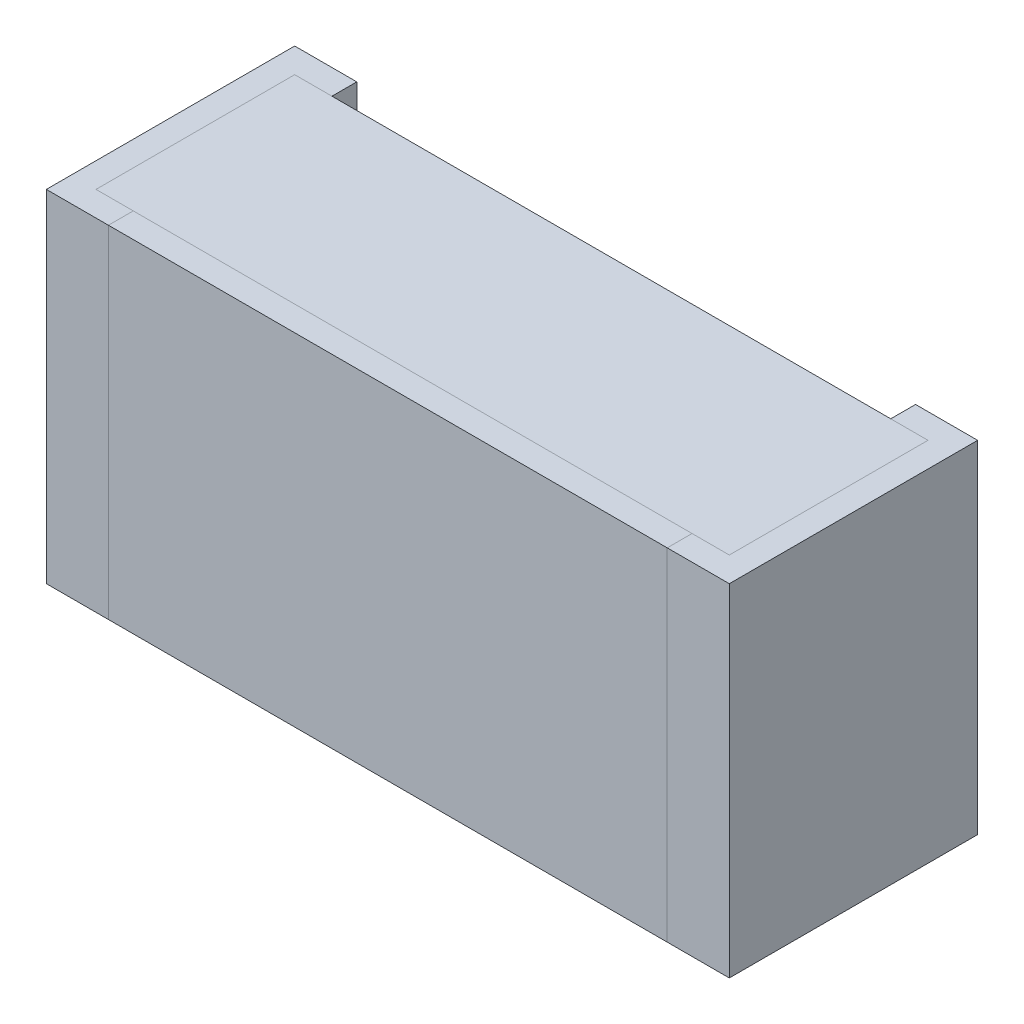
ISO-10303-21;
HEADER;
FILE_DESCRIPTION(('STEP AP214'),'2;1');
FILE_NAME('part.step','',(''),(''),'','','');
FILE_SCHEMA(('AUTOMOTIVE_DESIGN { 1 0 10303 214 1 1 1 1 }'));
ENDSEC;
DATA;
#1=APPLICATION_CONTEXT('core data for automotive mechanical design processes');
#2=APPLICATION_PROTOCOL_DEFINITION('international standard','automotive_design',2000,#1);
#3=PRODUCT_CONTEXT('',#1,'mechanical');
#4=PRODUCT('Part','Part','',(#3));
#5=PRODUCT_RELATED_PRODUCT_CATEGORY('part','',(#4));
#6=PRODUCT_DEFINITION_FORMATION('','',#4);
#7=PRODUCT_DEFINITION_CONTEXT('part definition',#1,'design');
#8=PRODUCT_DEFINITION('design','',#6,#7);
#9=PRODUCT_DEFINITION_SHAPE('','',#8);
#10=(LENGTH_UNIT() NAMED_UNIT(*) SI_UNIT(.MILLI.,.METRE.));
#11=(NAMED_UNIT(*) PLANE_ANGLE_UNIT() SI_UNIT($,.RADIAN.));
#12=(NAMED_UNIT(*) SI_UNIT($,.STERADIAN.) SOLID_ANGLE_UNIT());
#13=UNCERTAINTY_MEASURE_WITH_UNIT(LENGTH_MEASURE(1.E-05),#10,'distance_accuracy_value','');
#14=(GEOMETRIC_REPRESENTATION_CONTEXT(3) GLOBAL_UNCERTAINTY_ASSIGNED_CONTEXT((#13)) GLOBAL_UNIT_ASSIGNED_CONTEXT((#10,
#11,#12)) REPRESENTATION_CONTEXT('',''));
#15=CARTESIAN_POINT('',(0.,0.,0.));
#16=DIRECTION('',(0.,0.,1.));
#17=DIRECTION('',(1.,0.,0.));
#18=AXIS2_PLACEMENT_3D('',#15,#16,#17);
#19=CARTESIAN_POINT('',(-0.51,-0.275,0.04));
#20=DIRECTION('',(1.,0.,0.));
#21=DIRECTION('',(0.,0.,1.));
#22=AXIS2_PLACEMENT_3D('',#19,#20,#21);
#23=PLANE('',#22);
#24=DIRECTION('',(0.,1.,0.));
#25=VECTOR('',#24,1.);
#26=CARTESIAN_POINT('',(-0.51,-0.275,0.36));
#27=LINE('',#26,#25);
#28=CARTESIAN_POINT('',(-0.51,-0.275,0.36));
#29=VERTEX_POINT('',#28);
#30=CARTESIAN_POINT('',(-0.51,0.275,0.36));
#31=VERTEX_POINT('',#30);
#32=EDGE_CURVE('P0_E11',#29,#31,#27,.T.);
#33=ORIENTED_EDGE('',*,*,#32,.T.);
#34=DIRECTION('',(0.,0.,1.));
#35=VECTOR('',#34,1.);
#36=CARTESIAN_POINT('',(-0.51,0.275,0.04));
#37=LINE('',#36,#35);
#38=CARTESIAN_POINT('',(-0.51,0.275,0.04));
#39=VERTEX_POINT('',#38);
#40=EDGE_CURVE('P0_E23',#39,#31,#37,.T.);
#41=ORIENTED_EDGE('',*,*,#40,.F.);
#42=DIRECTION('',(0.,1.,0.));
#43=VECTOR('',#42,1.);
#44=CARTESIAN_POINT('',(-0.51,-0.275,0.04));
#45=LINE('',#44,#43);
#46=CARTESIAN_POINT('',(-0.51,-0.275,0.04));
#47=VERTEX_POINT('',#46);
#48=EDGE_CURVE('P0_E85',#47,#39,#45,.T.);
#49=ORIENTED_EDGE('',*,*,#48,.F.);
#50=DIRECTION('',(0.,0.,1.));
#51=VECTOR('',#50,1.);
#52=CARTESIAN_POINT('',(-0.51,-0.275,0.04));
#53=LINE('',#52,#51);
#54=EDGE_CURVE('P0_E35',#47,#29,#53,.T.);
#55=ORIENTED_EDGE('',*,*,#54,.T.);
#56=EDGE_LOOP('',(#33,#41,#49,#55));
#57=FACE_BOUND('',#56,.T.);
#58=ADVANCED_FACE('P0_F16',(#57),#23,.F.);
#59=CARTESIAN_POINT('',(0.51,-0.275,0.04));
#60=DIRECTION('',(1.,0.,0.));
#61=DIRECTION('',(0.,0.,1.));
#62=AXIS2_PLACEMENT_3D('',#59,#60,#61);
#63=PLANE('',#62);
#64=DIRECTION('',(0.,0.,1.));
#65=VECTOR('',#64,1.);
#66=CARTESIAN_POINT('',(0.51,-0.275,0.04));
#67=LINE('',#66,#65);
#68=CARTESIAN_POINT('',(0.51,-0.275,0.04));
#69=VERTEX_POINT('',#68);
#70=CARTESIAN_POINT('',(0.51,-0.275,0.36));
#71=VERTEX_POINT('',#70);
#72=EDGE_CURVE('P0_E82',#69,#71,#67,.T.);
#73=ORIENTED_EDGE('',*,*,#72,.F.);
#74=DIRECTION('',(0.,1.,0.));
#75=VECTOR('',#74,1.);
#76=CARTESIAN_POINT('',(0.51,-0.275,0.04));
#77=LINE('',#76,#75);
#78=CARTESIAN_POINT('',(0.51,0.275,0.04));
#79=VERTEX_POINT('',#78);
#80=EDGE_CURVE('P0_E62',#69,#79,#77,.T.);
#81=ORIENTED_EDGE('',*,*,#80,.T.);
#82=DIRECTION('',(0.,0.,1.));
#83=VECTOR('',#82,1.);
#84=CARTESIAN_POINT('',(0.51,0.275,0.04));
#85=LINE('',#84,#83);
#86=CARTESIAN_POINT('',(0.51,0.275,0.36));
#87=VERTEX_POINT('',#86);
#88=EDGE_CURVE('P0_E56',#79,#87,#85,.T.);
#89=ORIENTED_EDGE('',*,*,#88,.T.);
#90=DIRECTION('',(0.,1.,0.));
#91=VECTOR('',#90,1.);
#92=CARTESIAN_POINT('',(0.51,-0.275,0.36));
#93=LINE('',#92,#91);
#94=EDGE_CURVE('P0_E59',#71,#87,#93,.T.);
#95=ORIENTED_EDGE('',*,*,#94,.F.);
#96=EDGE_LOOP('',(#73,#81,#89,#95));
#97=FACE_BOUND('',#96,.T.);
#98=ADVANCED_FACE('P0_F58',(#97),#63,.T.);
#99=CARTESIAN_POINT('',(-0.51,-0.275,0.04));
#100=DIRECTION('',(0.,1.,0.));
#101=DIRECTION('',(0.,0.,1.));
#102=AXIS2_PLACEMENT_3D('',#99,#100,#101);
#103=PLANE('',#102);
#104=ORIENTED_EDGE('',*,*,#72,.T.);
#105=DIRECTION('',(1.,0.,0.));
#106=VECTOR('',#105,1.);
#107=CARTESIAN_POINT('',(-0.51,-0.275,0.36));
#108=LINE('',#107,#106);
#109=EDGE_CURVE('P0_E70',#29,#71,#108,.T.);
#110=ORIENTED_EDGE('',*,*,#109,.F.);
#111=ORIENTED_EDGE('',*,*,#54,.F.);
#112=DIRECTION('',(1.,0.,0.));
#113=VECTOR('',#112,1.);
#114=CARTESIAN_POINT('',(-0.51,-0.275,0.04));
#115=LINE('',#114,#113);
#116=EDGE_CURVE('P0_E75',#47,#69,#115,.T.);
#117=ORIENTED_EDGE('',*,*,#116,.T.);
#118=EDGE_LOOP('',(#104,#110,#111,#117));
#119=FACE_BOUND('',#118,.T.);
#120=ADVANCED_FACE('P0_F90',(#119),#103,.F.);
#121=CARTESIAN_POINT('',(-0.51,0.275,0.04));
#122=DIRECTION('',(0.,1.,0.));
#123=DIRECTION('',(0.,0.,1.));
#124=AXIS2_PLACEMENT_3D('',#121,#122,#123);
#125=PLANE('',#124);
#126=DIRECTION('',(1.,0.,0.));
#127=VECTOR('',#126,1.);
#128=CARTESIAN_POINT('',(-0.51,0.275,0.04));
#129=LINE('',#128,#127);
#130=EDGE_CURVE('P0_E73',#39,#79,#129,.T.);
#131=ORIENTED_EDGE('',*,*,#130,.F.);
#132=ORIENTED_EDGE('',*,*,#40,.T.);
#133=DIRECTION('',(1.,0.,0.));
#134=VECTOR('',#133,1.);
#135=CARTESIAN_POINT('',(-0.51,0.275,0.36));
#136=LINE('',#135,#134);
#137=EDGE_CURVE('P0_E68',#31,#87,#136,.T.);
#138=ORIENTED_EDGE('',*,*,#137,.T.);
#139=ORIENTED_EDGE('',*,*,#88,.F.);
#140=EDGE_LOOP('',(#131,#132,#138,#139));
#141=FACE_BOUND('',#140,.T.);
#142=ADVANCED_FACE('P0_F72',(#141),#125,.T.);
#143=CARTESIAN_POINT('',(-0.51,-0.275,0.04));
#144=DIRECTION('',(0.,0.,1.));
#145=DIRECTION('',(1.,0.,0.));
#146=AXIS2_PLACEMENT_3D('',#143,#144,#145);
#147=PLANE('',#146);
#148=ORIENTED_EDGE('',*,*,#130,.T.);
#149=ORIENTED_EDGE('',*,*,#80,.F.);
#150=ORIENTED_EDGE('',*,*,#116,.F.);
#151=ORIENTED_EDGE('',*,*,#48,.T.);
#152=EDGE_LOOP('',(#148,#149,#150,#151));
#153=FACE_BOUND('',#152,.T.);
#154=ADVANCED_FACE('P0_F88',(#153),#147,.F.);
#155=CARTESIAN_POINT('',(-0.51,-0.275,0.36));
#156=DIRECTION('',(0.,0.,1.));
#157=DIRECTION('',(1.,0.,0.));
#158=AXIS2_PLACEMENT_3D('',#155,#156,#157);
#159=PLANE('',#158);
#160=ORIENTED_EDGE('',*,*,#32,.F.);
#161=ORIENTED_EDGE('',*,*,#109,.T.);
#162=ORIENTED_EDGE('',*,*,#94,.T.);
#163=ORIENTED_EDGE('',*,*,#137,.F.);
#164=EDGE_LOOP('',(#160,#161,#162,#163));
#165=FACE_BOUND('',#164,.T.);
#166=ADVANCED_FACE('P0_F67',(#165),#159,.T.);
#167=CLOSED_SHELL('',(#58,#98,#120,#142,#154,#166));
#168=MANIFOLD_SOLID_BREP('P0_B1',#167);
#169=CARTESIAN_POINT('',(-0.55,-0.275,0.));
#170=DIRECTION('',(1.,0.,0.));
#171=DIRECTION('',(0.,0.,1.));
#172=AXIS2_PLACEMENT_3D('',#169,#170,#171);
#173=PLANE('',#172);
#174=DIRECTION('',(0.,1.,0.));
#175=VECTOR('',#174,1.);
#176=CARTESIAN_POINT('',(-0.55,-0.275,0.4));
#177=LINE('',#176,#175);
#178=CARTESIAN_POINT('',(-0.55,-0.275,0.4));
#179=VERTEX_POINT('',#178);
#180=CARTESIAN_POINT('',(-0.55,0.275,0.4));
#181=VERTEX_POINT('',#180);
#182=EDGE_CURVE('P1_E11',#179,#181,#177,.T.);
#183=ORIENTED_EDGE('',*,*,#182,.T.);
#184=DIRECTION('',(0.,0.,1.));
#185=VECTOR('',#184,1.);
#186=CARTESIAN_POINT('',(-0.55,0.275,0.));
#187=LINE('',#186,#185);
#188=CARTESIAN_POINT('',(-0.55,0.275,0.));
#189=VERTEX_POINT('',#188);
#190=EDGE_CURVE('P1_E23',#189,#181,#187,.T.);
#191=ORIENTED_EDGE('',*,*,#190,.F.);
#192=DIRECTION('',(0.,1.,0.));
#193=VECTOR('',#192,1.);
#194=CARTESIAN_POINT('',(-0.55,-0.275,0.));
#195=LINE('',#194,#193);
#196=CARTESIAN_POINT('',(-0.55,-0.275,0.));
#197=VERTEX_POINT('',#196);
#198=EDGE_CURVE('P1_E143',#197,#189,#195,.T.);
#199=ORIENTED_EDGE('',*,*,#198,.F.);
#200=DIRECTION('',(0.,0.,1.));
#201=VECTOR('',#200,1.);
#202=CARTESIAN_POINT('',(-0.55,-0.275,0.));
#203=LINE('',#202,#201);
#204=EDGE_CURVE('P1_E35',#197,#179,#203,.T.);
#205=ORIENTED_EDGE('',*,*,#204,.T.);
#206=EDGE_LOOP('',(#183,#191,#199,#205));
#207=FACE_BOUND('',#206,.T.);
#208=ADVANCED_FACE('P1_F16',(#207),#173,.F.);
#209=CARTESIAN_POINT('',(-0.55,-0.275,0.));
#210=DIRECTION('',(0.,1.,0.));
#211=DIRECTION('',(0.,0.,1.));
#212=AXIS2_PLACEMENT_3D('',#209,#210,#211);
#213=PLANE('',#212);
#214=DIRECTION('',(1.,0.,0.));
#215=VECTOR('',#214,1.);
#216=CARTESIAN_POINT('',(-0.51,-0.275,0.04));
#217=LINE('',#216,#215);
#218=CARTESIAN_POINT('',(-0.51,-0.275,0.04));
#219=VERTEX_POINT('',#218);
#220=CARTESIAN_POINT('',(-0.45,-0.275,0.04));
#221=VERTEX_POINT('',#220);
#222=EDGE_CURVE('P1_E140',#219,#221,#217,.T.);
#223=ORIENTED_EDGE('',*,*,#222,.F.);
#224=DIRECTION('',(0.,0.,1.));
#225=VECTOR('',#224,1.);
#226=CARTESIAN_POINT('',(-0.51,-0.275,0.04));
#227=LINE('',#226,#225);
#228=CARTESIAN_POINT('',(-0.51,-0.275,0.36));
#229=VERTEX_POINT('',#228);
#230=EDGE_CURVE('P1_E102',#219,#229,#227,.T.);
#231=ORIENTED_EDGE('',*,*,#230,.T.);
#232=DIRECTION('',(1.,0.,0.));
#233=VECTOR('',#232,1.);
#234=CARTESIAN_POINT('',(-0.51,-0.275,0.36));
#235=LINE('',#234,#233);
#236=CARTESIAN_POINT('',(-0.45,-0.275,0.36));
#237=VERTEX_POINT('',#236);
#238=EDGE_CURVE('P1_E136',#229,#237,#235,.T.);
#239=ORIENTED_EDGE('',*,*,#238,.T.);
#240=DIRECTION('',(0.,0.,1.));
#241=VECTOR('',#240,1.);
#242=CARTESIAN_POINT('',(-0.45,-0.275,0.));
#243=LINE('',#242,#241);
#244=CARTESIAN_POINT('',(-0.45,-0.275,0.4));
#245=VERTEX_POINT('',#244);
#246=EDGE_CURVE('P1_E133',#237,#245,#243,.T.);
#247=ORIENTED_EDGE('',*,*,#246,.T.);
#248=DIRECTION('',(1.,0.,0.));
#249=VECTOR('',#248,1.);
#250=CARTESIAN_POINT('',(-0.55,-0.275,0.4));
#251=LINE('',#250,#249);
#252=EDGE_CURVE('P1_E131',#179,#245,#251,.T.);
#253=ORIENTED_EDGE('',*,*,#252,.F.);
#254=ORIENTED_EDGE('',*,*,#204,.F.);
#255=DIRECTION('',(1.,0.,0.));
#256=VECTOR('',#255,1.);
#257=CARTESIAN_POINT('',(-0.55,-0.275,0.));
#258=LINE('',#257,#256);
#259=CARTESIAN_POINT('',(-0.45,-0.275,0.));
#260=VERTEX_POINT('',#259);
#261=EDGE_CURVE('P1_E128',#197,#260,#258,.T.);
#262=ORIENTED_EDGE('',*,*,#261,.T.);
#263=DIRECTION('',(0.,0.,1.));
#264=VECTOR('',#263,1.);
#265=CARTESIAN_POINT('',(-0.45,-0.275,0.));
#266=LINE('',#265,#264);
#267=EDGE_CURVE('P1_E126',#260,#221,#266,.T.);
#268=ORIENTED_EDGE('',*,*,#267,.T.);
#269=EDGE_LOOP('',(#223,#231,#239,#247,#253,#254,#262,#268));
#270=FACE_BOUND('',#269,.T.);
#271=ADVANCED_FACE('P1_F152',(#270),#213,.F.);
#272=CARTESIAN_POINT('',(-0.55,-0.275,0.4));
#273=DIRECTION('',(0.,0.,1.));
#274=DIRECTION('',(1.,0.,0.));
#275=AXIS2_PLACEMENT_3D('',#272,#273,#274);
#276=PLANE('',#275);
#277=ORIENTED_EDGE('',*,*,#182,.F.);
#278=ORIENTED_EDGE('',*,*,#252,.T.);
#279=DIRECTION('',(0.,1.,0.));
#280=VECTOR('',#279,1.);
#281=CARTESIAN_POINT('',(-0.45,-0.275,0.4));
#282=LINE('',#281,#280);
#283=CARTESIAN_POINT('',(-0.45,0.275,0.4));
#284=VERTEX_POINT('',#283);
#285=EDGE_CURVE('P1_E124',#245,#284,#282,.T.);
#286=ORIENTED_EDGE('',*,*,#285,.T.);
#287=DIRECTION('',(1.,0.,0.));
#288=VECTOR('',#287,1.);
#289=CARTESIAN_POINT('',(-0.55,0.275,0.4));
#290=LINE('',#289,#288);
#291=EDGE_CURVE('P1_E122',#181,#284,#290,.T.);
#292=ORIENTED_EDGE('',*,*,#291,.F.);
#293=EDGE_LOOP('',(#277,#278,#286,#292));
#294=FACE_BOUND('',#293,.T.);
#295=ADVANCED_FACE('P1_F156',(#294),#276,.T.);
#296=CARTESIAN_POINT('',(-0.55,0.275,0.));
#297=DIRECTION('',(0.,1.,0.));
#298=DIRECTION('',(0.,0.,1.));
#299=AXIS2_PLACEMENT_3D('',#296,#297,#298);
#300=PLANE('',#299);
#301=DIRECTION('',(0.,0.,1.));
#302=VECTOR('',#301,1.);
#303=CARTESIAN_POINT('',(-0.45,0.275,0.));
#304=LINE('',#303,#302);
#305=CARTESIAN_POINT('',(-0.45,0.275,0.));
#306=VERTEX_POINT('',#305);
#307=CARTESIAN_POINT('',(-0.45,0.275,0.04));
#308=VERTEX_POINT('',#307);
#309=EDGE_CURVE('P1_E120',#306,#308,#304,.T.);
#310=ORIENTED_EDGE('',*,*,#309,.F.);
#311=DIRECTION('',(1.,0.,0.));
#312=VECTOR('',#311,1.);
#313=CARTESIAN_POINT('',(-0.55,0.275,0.));
#314=LINE('',#313,#312);
#315=EDGE_CURVE('P1_E117',#189,#306,#314,.T.);
#316=ORIENTED_EDGE('',*,*,#315,.F.);
#317=ORIENTED_EDGE('',*,*,#190,.T.);
#318=ORIENTED_EDGE('',*,*,#291,.T.);
#319=DIRECTION('',(0.,0.,1.));
#320=VECTOR('',#319,1.);
#321=CARTESIAN_POINT('',(-0.45,0.275,0.));
#322=LINE('',#321,#320);
#323=CARTESIAN_POINT('',(-0.45,0.275,0.36));
#324=VERTEX_POINT('',#323);
#325=EDGE_CURVE('P1_E114',#324,#284,#322,.T.);
#326=ORIENTED_EDGE('',*,*,#325,.F.);
#327=DIRECTION('',(1.,0.,0.));
#328=VECTOR('',#327,1.);
#329=CARTESIAN_POINT('',(-0.51,0.275,0.36));
#330=LINE('',#329,#328);
#331=CARTESIAN_POINT('',(-0.51,0.275,0.36));
#332=VERTEX_POINT('',#331);
#333=EDGE_CURVE('P1_E85',#332,#324,#330,.T.);
#334=ORIENTED_EDGE('',*,*,#333,.F.);
#335=DIRECTION('',(0.,0.,1.));
#336=VECTOR('',#335,1.);
#337=CARTESIAN_POINT('',(-0.51,0.275,0.04));
#338=LINE('',#337,#336);
#339=CARTESIAN_POINT('',(-0.51,0.275,0.04));
#340=VERTEX_POINT('',#339);
#341=EDGE_CURVE('P1_E79',#340,#332,#338,.T.);
#342=ORIENTED_EDGE('',*,*,#341,.F.);
#343=DIRECTION('',(1.,0.,0.));
#344=VECTOR('',#343,1.);
#345=CARTESIAN_POINT('',(-0.51,0.275,0.04));
#346=LINE('',#345,#344);
#347=EDGE_CURVE('P1_E82',#340,#308,#346,.T.);
#348=ORIENTED_EDGE('',*,*,#347,.T.);
#349=EDGE_LOOP('',(#310,#316,#317,#318,#326,#334,#342,#348));
#350=FACE_BOUND('',#349,.T.);
#351=ADVANCED_FACE('P1_F81',(#350),#300,.T.);
#352=CARTESIAN_POINT('',(-0.55,-0.275,0.));
#353=DIRECTION('',(0.,0.,1.));
#354=DIRECTION('',(1.,0.,0.));
#355=AXIS2_PLACEMENT_3D('',#352,#353,#354);
#356=PLANE('',#355);
#357=ORIENTED_EDGE('',*,*,#315,.T.);
#358=DIRECTION('',(0.,1.,0.));
#359=VECTOR('',#358,1.);
#360=CARTESIAN_POINT('',(-0.45,-0.275,0.));
#361=LINE('',#360,#359);
#362=EDGE_CURVE('P1_E98',#260,#306,#361,.T.);
#363=ORIENTED_EDGE('',*,*,#362,.F.);
#364=ORIENTED_EDGE('',*,*,#261,.F.);
#365=ORIENTED_EDGE('',*,*,#198,.T.);
#366=EDGE_LOOP('',(#357,#363,#364,#365));
#367=FACE_BOUND('',#366,.T.);
#368=ADVANCED_FACE('P1_F146',(#367),#356,.F.);
#369=CARTESIAN_POINT('',(-0.45,-0.275,0.));
#370=DIRECTION('',(1.,0.,0.));
#371=DIRECTION('',(0.,0.,1.));
#372=AXIS2_PLACEMENT_3D('',#369,#370,#371);
#373=PLANE('',#372);
#374=ORIENTED_EDGE('',*,*,#267,.F.);
#375=ORIENTED_EDGE('',*,*,#362,.T.);
#376=ORIENTED_EDGE('',*,*,#309,.T.);
#377=DIRECTION('',(0.,-1.,0.));
#378=VECTOR('',#377,1.);
#379=CARTESIAN_POINT('',(-0.45,-0.275,0.04));
#380=LINE('',#379,#378);
#381=EDGE_CURVE('P1_E97',#308,#221,#380,.T.);
#382=ORIENTED_EDGE('',*,*,#381,.T.);
#383=EDGE_LOOP('',(#374,#375,#376,#382));
#384=FACE_BOUND('',#383,.T.);
#385=ADVANCED_FACE('P1_F150',(#384),#373,.T.);
#386=CARTESIAN_POINT('',(-0.51,-0.275,0.04));
#387=DIRECTION('',(0.,0.,1.));
#388=DIRECTION('',(1.,0.,0.));
#389=AXIS2_PLACEMENT_3D('',#386,#387,#388);
#390=PLANE('',#389);
#391=ORIENTED_EDGE('',*,*,#347,.F.);
#392=DIRECTION('',(0.,1.,0.));
#393=VECTOR('',#392,1.);
#394=CARTESIAN_POINT('',(-0.51,-0.275,0.04));
#395=LINE('',#394,#393);
#396=EDGE_CURVE('P1_E95',#219,#340,#395,.T.);
#397=ORIENTED_EDGE('',*,*,#396,.F.);
#398=ORIENTED_EDGE('',*,*,#222,.T.);
#399=ORIENTED_EDGE('',*,*,#381,.F.);
#400=EDGE_LOOP('',(#391,#397,#398,#399));
#401=FACE_BOUND('',#400,.T.);
#402=ADVANCED_FACE('P1_F93',(#401),#390,.T.);
#403=CARTESIAN_POINT('',(-0.51,-0.275,0.04));
#404=DIRECTION('',(1.,0.,0.));
#405=DIRECTION('',(0.,0.,1.));
#406=AXIS2_PLACEMENT_3D('',#403,#404,#405);
#407=PLANE('',#406);
#408=ORIENTED_EDGE('',*,*,#230,.F.);
#409=ORIENTED_EDGE('',*,*,#396,.T.);
#410=ORIENTED_EDGE('',*,*,#341,.T.);
#411=DIRECTION('',(0.,1.,0.));
#412=VECTOR('',#411,1.);
#413=CARTESIAN_POINT('',(-0.51,-0.275,0.36));
#414=LINE('',#413,#412);
#415=EDGE_CURVE('P1_E104',#229,#332,#414,.T.);
#416=ORIENTED_EDGE('',*,*,#415,.F.);
#417=EDGE_LOOP('',(#408,#409,#410,#416));
#418=FACE_BOUND('',#417,.T.);
#419=ADVANCED_FACE('P1_F100',(#418),#407,.T.);
#420=CARTESIAN_POINT('',(-0.51,-0.275,0.36));
#421=DIRECTION('',(0.,0.,1.));
#422=DIRECTION('',(1.,0.,0.));
#423=AXIS2_PLACEMENT_3D('',#420,#421,#422);
#424=PLANE('',#423);
#425=DIRECTION('',(0.,-1.,0.));
#426=VECTOR('',#425,1.);
#427=CARTESIAN_POINT('',(-0.45,-0.275,0.36));
#428=LINE('',#427,#426);
#429=EDGE_CURVE('P1_E107',#324,#237,#428,.T.);
#430=ORIENTED_EDGE('',*,*,#429,.T.);
#431=ORIENTED_EDGE('',*,*,#238,.F.);
#432=ORIENTED_EDGE('',*,*,#415,.T.);
#433=ORIENTED_EDGE('',*,*,#333,.T.);
#434=EDGE_LOOP('',(#430,#431,#432,#433));
#435=FACE_BOUND('',#434,.T.);
#436=ADVANCED_FACE('P1_F162',(#435),#424,.F.);
#437=CARTESIAN_POINT('',(-0.45,-0.275,0.));
#438=DIRECTION('',(1.,0.,0.));
#439=DIRECTION('',(0.,0.,1.));
#440=AXIS2_PLACEMENT_3D('',#437,#438,#439);
#441=PLANE('',#440);
#442=ORIENTED_EDGE('',*,*,#246,.F.);
#443=ORIENTED_EDGE('',*,*,#429,.F.);
#444=ORIENTED_EDGE('',*,*,#325,.T.);
#445=ORIENTED_EDGE('',*,*,#285,.F.);
#446=EDGE_LOOP('',(#442,#443,#444,#445));
#447=FACE_BOUND('',#446,.T.);
#448=ADVANCED_FACE('P1_F159',(#447),#441,.T.);
#449=CLOSED_SHELL('',(#208,#271,#295,#351,#368,#385,#402,#419,#436,#448));
#450=MANIFOLD_SOLID_BREP('P1_B1',#449);
#451=CARTESIAN_POINT('',(0.55,0.275,0.));
#452=DIRECTION('',(-1.,0.,0.));
#453=DIRECTION('',(0.,0.,1.));
#454=AXIS2_PLACEMENT_3D('',#451,#452,#453);
#455=PLANE('',#454);
#456=DIRECTION('',(0.,-1.,0.));
#457=VECTOR('',#456,1.);
#458=CARTESIAN_POINT('',(0.55,0.275,0.4));
#459=LINE('',#458,#457);
#460=CARTESIAN_POINT('',(0.55,0.275,0.4));
#461=VERTEX_POINT('',#460);
#462=CARTESIAN_POINT('',(0.55,-0.275,0.4));
#463=VERTEX_POINT('',#462);
#464=EDGE_CURVE('P2_E11',#461,#463,#459,.T.);
#465=ORIENTED_EDGE('',*,*,#464,.T.);
#466=DIRECTION('',(0.,0.,1.));
#467=VECTOR('',#466,1.);
#468=CARTESIAN_POINT('',(0.55,-0.275,0.));
#469=LINE('',#468,#467);
#470=CARTESIAN_POINT('',(0.55,-0.275,0.));
#471=VERTEX_POINT('',#470);
#472=EDGE_CURVE('P2_E23',#471,#463,#469,.T.);
#473=ORIENTED_EDGE('',*,*,#472,.F.);
#474=DIRECTION('',(0.,-1.,0.));
#475=VECTOR('',#474,1.);
#476=CARTESIAN_POINT('',(0.55,0.275,0.));
#477=LINE('',#476,#475);
#478=CARTESIAN_POINT('',(0.55,0.275,0.));
#479=VERTEX_POINT('',#478);
#480=EDGE_CURVE('P2_E143',#479,#471,#477,.T.);
#481=ORIENTED_EDGE('',*,*,#480,.F.);
#482=DIRECTION('',(0.,0.,1.));
#483=VECTOR('',#482,1.);
#484=CARTESIAN_POINT('',(0.55,0.275,0.));
#485=LINE('',#484,#483);
#486=EDGE_CURVE('P2_E35',#479,#461,#485,.T.);
#487=ORIENTED_EDGE('',*,*,#486,.T.);
#488=EDGE_LOOP('',(#465,#473,#481,#487));
#489=FACE_BOUND('',#488,.T.);
#490=ADVANCED_FACE('P2_F16',(#489),#455,.F.);
#491=CARTESIAN_POINT('',(0.55,0.275,0.));
#492=DIRECTION('',(0.,-1.,0.));
#493=DIRECTION('',(0.,0.,1.));
#494=AXIS2_PLACEMENT_3D('',#491,#492,#493);
#495=PLANE('',#494);
#496=DIRECTION('',(-1.,0.,0.));
#497=VECTOR('',#496,1.);
#498=CARTESIAN_POINT('',(0.51,0.275,0.04));
#499=LINE('',#498,#497);
#500=CARTESIAN_POINT('',(0.51,0.275,0.04));
#501=VERTEX_POINT('',#500);
#502=CARTESIAN_POINT('',(0.45,0.275,0.04));
#503=VERTEX_POINT('',#502);
#504=EDGE_CURVE('P2_E140',#501,#503,#499,.T.);
#505=ORIENTED_EDGE('',*,*,#504,.F.);
#506=DIRECTION('',(0.,0.,1.));
#507=VECTOR('',#506,1.);
#508=CARTESIAN_POINT('',(0.51,0.275,0.04));
#509=LINE('',#508,#507);
#510=CARTESIAN_POINT('',(0.51,0.275,0.36));
#511=VERTEX_POINT('',#510);
#512=EDGE_CURVE('P2_E102',#501,#511,#509,.T.);
#513=ORIENTED_EDGE('',*,*,#512,.T.);
#514=DIRECTION('',(-1.,0.,0.));
#515=VECTOR('',#514,1.);
#516=CARTESIAN_POINT('',(0.51,0.275,0.36));
#517=LINE('',#516,#515);
#518=CARTESIAN_POINT('',(0.45,0.275,0.36));
#519=VERTEX_POINT('',#518);
#520=EDGE_CURVE('P2_E136',#511,#519,#517,.T.);
#521=ORIENTED_EDGE('',*,*,#520,.T.);
#522=DIRECTION('',(0.,0.,1.));
#523=VECTOR('',#522,1.);
#524=CARTESIAN_POINT('',(0.45,0.275,0.));
#525=LINE('',#524,#523);
#526=CARTESIAN_POINT('',(0.45,0.275,0.4));
#527=VERTEX_POINT('',#526);
#528=EDGE_CURVE('P2_E133',#519,#527,#525,.T.);
#529=ORIENTED_EDGE('',*,*,#528,.T.);
#530=DIRECTION('',(-1.,0.,0.));
#531=VECTOR('',#530,1.);
#532=CARTESIAN_POINT('',(0.55,0.275,0.4));
#533=LINE('',#532,#531);
#534=EDGE_CURVE('P2_E131',#461,#527,#533,.T.);
#535=ORIENTED_EDGE('',*,*,#534,.F.);
#536=ORIENTED_EDGE('',*,*,#486,.F.);
#537=DIRECTION('',(-1.,0.,0.));
#538=VECTOR('',#537,1.);
#539=CARTESIAN_POINT('',(0.55,0.275,0.));
#540=LINE('',#539,#538);
#541=CARTESIAN_POINT('',(0.45,0.275,0.));
#542=VERTEX_POINT('',#541);
#543=EDGE_CURVE('P2_E128',#479,#542,#540,.T.);
#544=ORIENTED_EDGE('',*,*,#543,.T.);
#545=DIRECTION('',(0.,0.,1.));
#546=VECTOR('',#545,1.);
#547=CARTESIAN_POINT('',(0.45,0.275,0.));
#548=LINE('',#547,#546);
#549=EDGE_CURVE('P2_E126',#542,#503,#548,.T.);
#550=ORIENTED_EDGE('',*,*,#549,.T.);
#551=EDGE_LOOP('',(#505,#513,#521,#529,#535,#536,#544,#550));
#552=FACE_BOUND('',#551,.T.);
#553=ADVANCED_FACE('P2_F152',(#552),#495,.F.);
#554=CARTESIAN_POINT('',(0.55,0.275,0.4));
#555=DIRECTION('',(0.,0.,1.));
#556=DIRECTION('',(-1.,0.,0.));
#557=AXIS2_PLACEMENT_3D('',#554,#555,#556);
#558=PLANE('',#557);
#559=ORIENTED_EDGE('',*,*,#464,.F.);
#560=ORIENTED_EDGE('',*,*,#534,.T.);
#561=DIRECTION('',(0.,-1.,0.));
#562=VECTOR('',#561,1.);
#563=CARTESIAN_POINT('',(0.45,0.275,0.4));
#564=LINE('',#563,#562);
#565=CARTESIAN_POINT('',(0.45,-0.275,0.4));
#566=VERTEX_POINT('',#565);
#567=EDGE_CURVE('P2_E124',#527,#566,#564,.T.);
#568=ORIENTED_EDGE('',*,*,#567,.T.);
#569=DIRECTION('',(-1.,0.,0.));
#570=VECTOR('',#569,1.);
#571=CARTESIAN_POINT('',(0.55,-0.275,0.4));
#572=LINE('',#571,#570);
#573=EDGE_CURVE('P2_E122',#463,#566,#572,.T.);
#574=ORIENTED_EDGE('',*,*,#573,.F.);
#575=EDGE_LOOP('',(#559,#560,#568,#574));
#576=FACE_BOUND('',#575,.T.);
#577=ADVANCED_FACE('P2_F156',(#576),#558,.T.);
#578=CARTESIAN_POINT('',(0.55,-0.275,0.));
#579=DIRECTION('',(0.,-1.,0.));
#580=DIRECTION('',(0.,0.,1.));
#581=AXIS2_PLACEMENT_3D('',#578,#579,#580);
#582=PLANE('',#581);
#583=DIRECTION('',(0.,0.,1.));
#584=VECTOR('',#583,1.);
#585=CARTESIAN_POINT('',(0.45,-0.275,0.));
#586=LINE('',#585,#584);
#587=CARTESIAN_POINT('',(0.45,-0.275,0.));
#588=VERTEX_POINT('',#587);
#589=CARTESIAN_POINT('',(0.45,-0.275,0.04));
#590=VERTEX_POINT('',#589);
#591=EDGE_CURVE('P2_E120',#588,#590,#586,.T.);
#592=ORIENTED_EDGE('',*,*,#591,.F.);
#593=DIRECTION('',(-1.,0.,0.));
#594=VECTOR('',#593,1.);
#595=CARTESIAN_POINT('',(0.55,-0.275,0.));
#596=LINE('',#595,#594);
#597=EDGE_CURVE('P2_E117',#471,#588,#596,.T.);
#598=ORIENTED_EDGE('',*,*,#597,.F.);
#599=ORIENTED_EDGE('',*,*,#472,.T.);
#600=ORIENTED_EDGE('',*,*,#573,.T.);
#601=DIRECTION('',(0.,0.,1.));
#602=VECTOR('',#601,1.);
#603=CARTESIAN_POINT('',(0.45,-0.275,0.));
#604=LINE('',#603,#602);
#605=CARTESIAN_POINT('',(0.45,-0.275,0.36));
#606=VERTEX_POINT('',#605);
#607=EDGE_CURVE('P2_E114',#606,#566,#604,.T.);
#608=ORIENTED_EDGE('',*,*,#607,.F.);
#609=DIRECTION('',(-1.,0.,0.));
#610=VECTOR('',#609,1.);
#611=CARTESIAN_POINT('',(0.51,-0.275,0.36));
#612=LINE('',#611,#610);
#613=CARTESIAN_POINT('',(0.51,-0.275,0.36));
#614=VERTEX_POINT('',#613);
#615=EDGE_CURVE('P2_E85',#614,#606,#612,.T.);
#616=ORIENTED_EDGE('',*,*,#615,.F.);
#617=DIRECTION('',(0.,0.,1.));
#618=VECTOR('',#617,1.);
#619=CARTESIAN_POINT('',(0.51,-0.275,0.04));
#620=LINE('',#619,#618);
#621=CARTESIAN_POINT('',(0.51,-0.275,0.04));
#622=VERTEX_POINT('',#621);
#623=EDGE_CURVE('P2_E79',#622,#614,#620,.T.);
#624=ORIENTED_EDGE('',*,*,#623,.F.);
#625=DIRECTION('',(-1.,0.,0.));
#626=VECTOR('',#625,1.);
#627=CARTESIAN_POINT('',(0.51,-0.275,0.04));
#628=LINE('',#627,#626);
#629=EDGE_CURVE('P2_E82',#622,#590,#628,.T.);
#630=ORIENTED_EDGE('',*,*,#629,.T.);
#631=EDGE_LOOP('',(#592,#598,#599,#600,#608,#616,#624,#630));
#632=FACE_BOUND('',#631,.T.);
#633=ADVANCED_FACE('P2_F81',(#632),#582,.T.);
#634=CARTESIAN_POINT('',(0.55,0.275,0.));
#635=DIRECTION('',(0.,0.,1.));
#636=DIRECTION('',(-1.,0.,0.));
#637=AXIS2_PLACEMENT_3D('',#634,#635,#636);
#638=PLANE('',#637);
#639=ORIENTED_EDGE('',*,*,#597,.T.);
#640=DIRECTION('',(0.,-1.,0.));
#641=VECTOR('',#640,1.);
#642=CARTESIAN_POINT('',(0.45,0.275,0.));
#643=LINE('',#642,#641);
#644=EDGE_CURVE('P2_E98',#542,#588,#643,.T.);
#645=ORIENTED_EDGE('',*,*,#644,.F.);
#646=ORIENTED_EDGE('',*,*,#543,.F.);
#647=ORIENTED_EDGE('',*,*,#480,.T.);
#648=EDGE_LOOP('',(#639,#645,#646,#647));
#649=FACE_BOUND('',#648,.T.);
#650=ADVANCED_FACE('P2_F146',(#649),#638,.F.);
#651=CARTESIAN_POINT('',(0.45,0.275,0.));
#652=DIRECTION('',(-1.,0.,0.));
#653=DIRECTION('',(0.,0.,1.));
#654=AXIS2_PLACEMENT_3D('',#651,#652,#653);
#655=PLANE('',#654);
#656=ORIENTED_EDGE('',*,*,#549,.F.);
#657=ORIENTED_EDGE('',*,*,#644,.T.);
#658=ORIENTED_EDGE('',*,*,#591,.T.);
#659=DIRECTION('',(0.,1.,0.));
#660=VECTOR('',#659,1.);
#661=CARTESIAN_POINT('',(0.45,0.275,0.04));
#662=LINE('',#661,#660);
#663=EDGE_CURVE('P2_E97',#590,#503,#662,.T.);
#664=ORIENTED_EDGE('',*,*,#663,.T.);
#665=EDGE_LOOP('',(#656,#657,#658,#664));
#666=FACE_BOUND('',#665,.T.);
#667=ADVANCED_FACE('P2_F150',(#666),#655,.T.);
#668=CARTESIAN_POINT('',(0.51,0.275,0.04));
#669=DIRECTION('',(0.,0.,1.));
#670=DIRECTION('',(-1.,0.,0.));
#671=AXIS2_PLACEMENT_3D('',#668,#669,#670);
#672=PLANE('',#671);
#673=ORIENTED_EDGE('',*,*,#629,.F.);
#674=DIRECTION('',(0.,-1.,0.));
#675=VECTOR('',#674,1.);
#676=CARTESIAN_POINT('',(0.51,0.275,0.04));
#677=LINE('',#676,#675);
#678=EDGE_CURVE('P2_E95',#501,#622,#677,.T.);
#679=ORIENTED_EDGE('',*,*,#678,.F.);
#680=ORIENTED_EDGE('',*,*,#504,.T.);
#681=ORIENTED_EDGE('',*,*,#663,.F.);
#682=EDGE_LOOP('',(#673,#679,#680,#681));
#683=FACE_BOUND('',#682,.T.);
#684=ADVANCED_FACE('P2_F93',(#683),#672,.T.);
#685=CARTESIAN_POINT('',(0.51,0.275,0.04));
#686=DIRECTION('',(-1.,0.,0.));
#687=DIRECTION('',(0.,0.,1.));
#688=AXIS2_PLACEMENT_3D('',#685,#686,#687);
#689=PLANE('',#688);
#690=ORIENTED_EDGE('',*,*,#512,.F.);
#691=ORIENTED_EDGE('',*,*,#678,.T.);
#692=ORIENTED_EDGE('',*,*,#623,.T.);
#693=DIRECTION('',(0.,-1.,0.));
#694=VECTOR('',#693,1.);
#695=CARTESIAN_POINT('',(0.51,0.275,0.36));
#696=LINE('',#695,#694);
#697=EDGE_CURVE('P2_E104',#511,#614,#696,.T.);
#698=ORIENTED_EDGE('',*,*,#697,.F.);
#699=EDGE_LOOP('',(#690,#691,#692,#698));
#700=FACE_BOUND('',#699,.T.);
#701=ADVANCED_FACE('P2_F100',(#700),#689,.T.);
#702=CARTESIAN_POINT('',(0.51,0.275,0.36));
#703=DIRECTION('',(0.,0.,1.));
#704=DIRECTION('',(-1.,0.,0.));
#705=AXIS2_PLACEMENT_3D('',#702,#703,#704);
#706=PLANE('',#705);
#707=DIRECTION('',(0.,1.,0.));
#708=VECTOR('',#707,1.);
#709=CARTESIAN_POINT('',(0.45,0.275,0.36));
#710=LINE('',#709,#708);
#711=EDGE_CURVE('P2_E107',#606,#519,#710,.T.);
#712=ORIENTED_EDGE('',*,*,#711,.T.);
#713=ORIENTED_EDGE('',*,*,#520,.F.);
#714=ORIENTED_EDGE('',*,*,#697,.T.);
#715=ORIENTED_EDGE('',*,*,#615,.T.);
#716=EDGE_LOOP('',(#712,#713,#714,#715));
#717=FACE_BOUND('',#716,.T.);
#718=ADVANCED_FACE('P2_F162',(#717),#706,.F.);
#719=CARTESIAN_POINT('',(0.45,0.275,0.));
#720=DIRECTION('',(-1.,0.,0.));
#721=DIRECTION('',(0.,0.,1.));
#722=AXIS2_PLACEMENT_3D('',#719,#720,#721);
#723=PLANE('',#722);
#724=ORIENTED_EDGE('',*,*,#528,.F.);
#725=ORIENTED_EDGE('',*,*,#711,.F.);
#726=ORIENTED_EDGE('',*,*,#607,.T.);
#727=ORIENTED_EDGE('',*,*,#567,.F.);
#728=EDGE_LOOP('',(#724,#725,#726,#727));
#729=FACE_BOUND('',#728,.T.);
#730=ADVANCED_FACE('P2_F159',(#729),#723,.T.);
#731=CLOSED_SHELL('',(#490,#553,#577,#633,#650,#667,#684,#701,#718,#730));
#732=MANIFOLD_SOLID_BREP('P2_B1',#731);
#733=CARTESIAN_POINT('',(-0.45,-0.275,0.36));
#734=DIRECTION('',(1.,0.,0.));
#735=DIRECTION('',(0.,0.,1.));
#736=AXIS2_PLACEMENT_3D('',#733,#734,#735);
#737=PLANE('',#736);
#738=DIRECTION('',(0.,1.,0.));
#739=VECTOR('',#738,1.);
#740=CARTESIAN_POINT('',(-0.45,-0.275,0.4));
#741=LINE('',#740,#739);
#742=CARTESIAN_POINT('',(-0.45,-0.275,0.4));
#743=VERTEX_POINT('',#742);
#744=CARTESIAN_POINT('',(-0.45,0.275,0.4));
#745=VERTEX_POINT('',#744);
#746=EDGE_CURVE('P3_E11',#743,#745,#741,.T.);
#747=ORIENTED_EDGE('',*,*,#746,.T.);
#748=DIRECTION('',(0.,0.,1.));
#749=VECTOR('',#748,1.);
#750=CARTESIAN_POINT('',(-0.45,0.275,0.36));
#751=LINE('',#750,#749);
#752=CARTESIAN_POINT('',(-0.45,0.275,0.36));
#753=VERTEX_POINT('',#752);
#754=EDGE_CURVE('P3_E23',#753,#745,#751,.T.);
#755=ORIENTED_EDGE('',*,*,#754,.F.);
#756=DIRECTION('',(0.,1.,0.));
#757=VECTOR('',#756,1.);
#758=CARTESIAN_POINT('',(-0.45,-0.275,0.36));
#759=LINE('',#758,#757);
#760=CARTESIAN_POINT('',(-0.45,-0.275,0.36));
#761=VERTEX_POINT('',#760);
#762=EDGE_CURVE('P3_E85',#761,#753,#759,.T.);
#763=ORIENTED_EDGE('',*,*,#762,.F.);
#764=DIRECTION('',(0.,0.,1.));
#765=VECTOR('',#764,1.);
#766=CARTESIAN_POINT('',(-0.45,-0.275,0.36));
#767=LINE('',#766,#765);
#768=EDGE_CURVE('P3_E35',#761,#743,#767,.T.);
#769=ORIENTED_EDGE('',*,*,#768,.T.);
#770=EDGE_LOOP('',(#747,#755,#763,#769));
#771=FACE_BOUND('',#770,.T.);
#772=ADVANCED_FACE('P3_F16',(#771),#737,.F.);
#773=CARTESIAN_POINT('',(0.45,-0.275,0.36));
#774=DIRECTION('',(1.,0.,0.));
#775=DIRECTION('',(0.,0.,1.));
#776=AXIS2_PLACEMENT_3D('',#773,#774,#775);
#777=PLANE('',#776);
#778=DIRECTION('',(0.,0.,1.));
#779=VECTOR('',#778,1.);
#780=CARTESIAN_POINT('',(0.45,-0.275,0.36));
#781=LINE('',#780,#779);
#782=CARTESIAN_POINT('',(0.45,-0.275,0.36));
#783=VERTEX_POINT('',#782);
#784=CARTESIAN_POINT('',(0.45,-0.275,0.4));
#785=VERTEX_POINT('',#784);
#786=EDGE_CURVE('P3_E82',#783,#785,#781,.T.);
#787=ORIENTED_EDGE('',*,*,#786,.F.);
#788=DIRECTION('',(0.,1.,0.));
#789=VECTOR('',#788,1.);
#790=CARTESIAN_POINT('',(0.45,-0.275,0.36));
#791=LINE('',#790,#789);
#792=CARTESIAN_POINT('',(0.45,0.275,0.36));
#793=VERTEX_POINT('',#792);
#794=EDGE_CURVE('P3_E62',#783,#793,#791,.T.);
#795=ORIENTED_EDGE('',*,*,#794,.T.);
#796=DIRECTION('',(0.,0.,1.));
#797=VECTOR('',#796,1.);
#798=CARTESIAN_POINT('',(0.45,0.275,0.36));
#799=LINE('',#798,#797);
#800=CARTESIAN_POINT('',(0.45,0.275,0.4));
#801=VERTEX_POINT('',#800);
#802=EDGE_CURVE('P3_E55',#793,#801,#799,.T.);
#803=ORIENTED_EDGE('',*,*,#802,.T.);
#804=DIRECTION('',(0.,1.,0.));
#805=VECTOR('',#804,1.);
#806=CARTESIAN_POINT('',(0.45,-0.275,0.4));
#807=LINE('',#806,#805);
#808=EDGE_CURVE('P3_E59',#785,#801,#807,.T.);
#809=ORIENTED_EDGE('',*,*,#808,.F.);
#810=EDGE_LOOP('',(#787,#795,#803,#809));
#811=FACE_BOUND('',#810,.T.);
#812=ADVANCED_FACE('P3_F58',(#811),#777,.T.);
#813=CARTESIAN_POINT('',(-0.45,-0.275,0.36));
#814=DIRECTION('',(0.,1.,0.));
#815=DIRECTION('',(0.,0.,1.));
#816=AXIS2_PLACEMENT_3D('',#813,#814,#815);
#817=PLANE('',#816);
#818=ORIENTED_EDGE('',*,*,#786,.T.);
#819=DIRECTION('',(1.,0.,0.));
#820=VECTOR('',#819,1.);
#821=CARTESIAN_POINT('',(-0.45,-0.275,0.4));
#822=LINE('',#821,#820);
#823=EDGE_CURVE('P3_E71',#743,#785,#822,.T.);
#824=ORIENTED_EDGE('',*,*,#823,.F.);
#825=ORIENTED_EDGE('',*,*,#768,.F.);
#826=DIRECTION('',(1.,0.,0.));
#827=VECTOR('',#826,1.);
#828=CARTESIAN_POINT('',(-0.45,-0.275,0.36));
#829=LINE('',#828,#827);
#830=EDGE_CURVE('P3_E76',#761,#783,#829,.T.);
#831=ORIENTED_EDGE('',*,*,#830,.T.);
#832=EDGE_LOOP('',(#818,#824,#825,#831));
#833=FACE_BOUND('',#832,.T.);
#834=ADVANCED_FACE('P3_F90',(#833),#817,.F.);
#835=CARTESIAN_POINT('',(-0.45,0.275,0.36));
#836=DIRECTION('',(0.,1.,0.));
#837=DIRECTION('',(0.,0.,1.));
#838=AXIS2_PLACEMENT_3D('',#835,#836,#837);
#839=PLANE('',#838);
#840=DIRECTION('',(1.,0.,0.));
#841=VECTOR('',#840,1.);
#842=CARTESIAN_POINT('',(-0.45,0.275,0.36));
#843=LINE('',#842,#841);
#844=EDGE_CURVE('P3_E74',#753,#793,#843,.T.);
#845=ORIENTED_EDGE('',*,*,#844,.F.);
#846=ORIENTED_EDGE('',*,*,#754,.T.);
#847=DIRECTION('',(1.,0.,0.));
#848=VECTOR('',#847,1.);
#849=CARTESIAN_POINT('',(-0.45,0.275,0.4));
#850=LINE('',#849,#848);
#851=EDGE_CURVE('P3_E69',#745,#801,#850,.T.);
#852=ORIENTED_EDGE('',*,*,#851,.T.);
#853=ORIENTED_EDGE('',*,*,#802,.F.);
#854=EDGE_LOOP('',(#845,#846,#852,#853));
#855=FACE_BOUND('',#854,.T.);
#856=ADVANCED_FACE('P3_F73',(#855),#839,.T.);
#857=CARTESIAN_POINT('',(-0.45,-0.275,0.36));
#858=DIRECTION('',(0.,0.,1.));
#859=DIRECTION('',(1.,0.,0.));
#860=AXIS2_PLACEMENT_3D('',#857,#858,#859);
#861=PLANE('',#860);
#862=ORIENTED_EDGE('',*,*,#844,.T.);
#863=ORIENTED_EDGE('',*,*,#794,.F.);
#864=ORIENTED_EDGE('',*,*,#830,.F.);
#865=ORIENTED_EDGE('',*,*,#762,.T.);
#866=EDGE_LOOP('',(#862,#863,#864,#865));
#867=FACE_BOUND('',#866,.T.);
#868=ADVANCED_FACE('P3_F88',(#867),#861,.F.);
#869=CARTESIAN_POINT('',(-0.45,-0.275,0.4));
#870=DIRECTION('',(0.,0.,1.));
#871=DIRECTION('',(1.,0.,0.));
#872=AXIS2_PLACEMENT_3D('',#869,#870,#871);
#873=PLANE('',#872);
#874=ORIENTED_EDGE('',*,*,#746,.F.);
#875=ORIENTED_EDGE('',*,*,#823,.T.);
#876=ORIENTED_EDGE('',*,*,#808,.T.);
#877=ORIENTED_EDGE('',*,*,#851,.F.);
#878=EDGE_LOOP('',(#874,#875,#876,#877));
#879=FACE_BOUND('',#878,.T.);
#880=ADVANCED_FACE('P3_F68',(#879),#873,.T.);
#881=CLOSED_SHELL('',(#772,#812,#834,#856,#868,#880));
#882=MANIFOLD_SOLID_BREP('P3_B1',#881);
#883=ADVANCED_BREP_SHAPE_REPRESENTATION('',(#18,#168,#450,#732,#882),#14);
#884=SHAPE_DEFINITION_REPRESENTATION(#9,#883);
ENDSEC;
END-ISO-10303-21;
